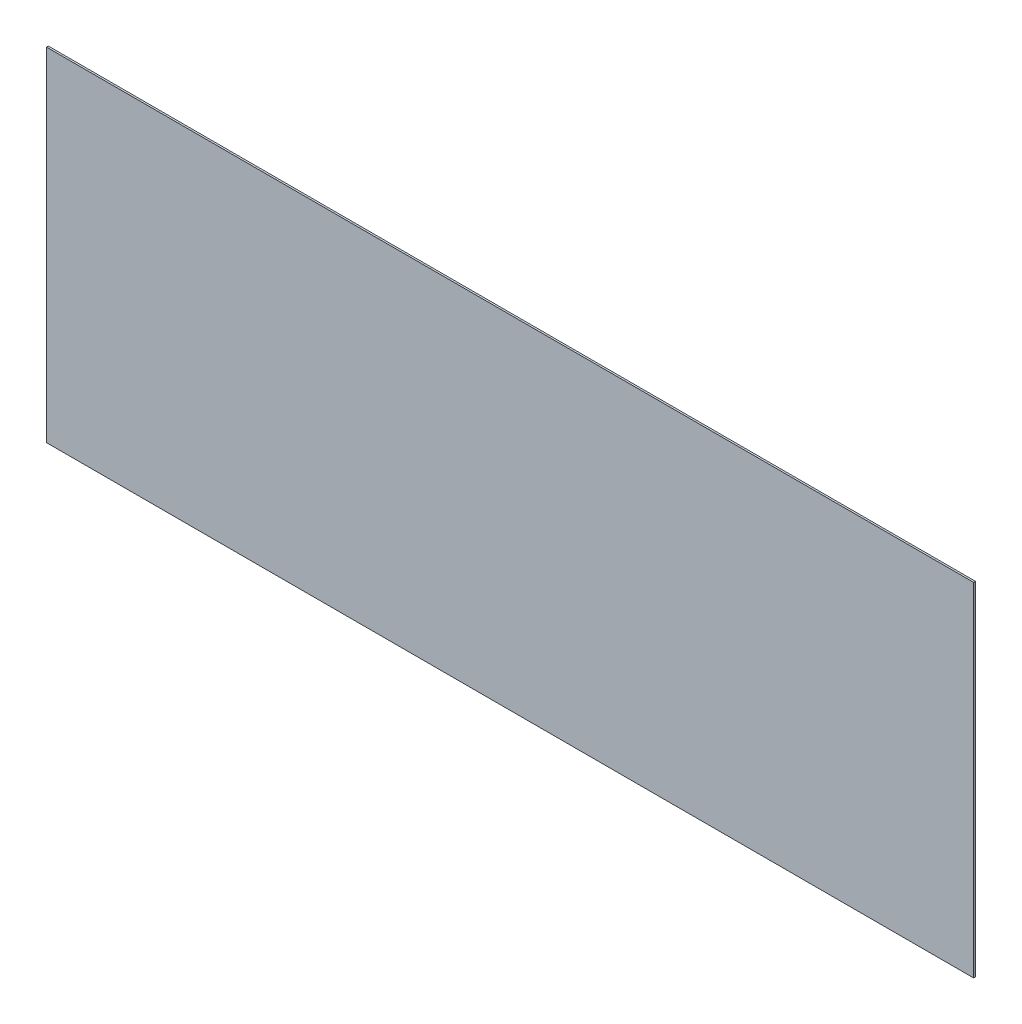
ISO-10303-21;
HEADER;
FILE_DESCRIPTION(('STEP AP214'),'2;1');
FILE_NAME('part.step','',(''),(''),'','','');
FILE_SCHEMA(('AUTOMOTIVE_DESIGN { 1 0 10303 214 1 1 1 1 }'));
ENDSEC;
DATA;
#1=APPLICATION_CONTEXT('core data for automotive mechanical design processes');
#2=APPLICATION_PROTOCOL_DEFINITION('international standard','automotive_design',2000,#1);
#3=PRODUCT_CONTEXT('',#1,'mechanical');
#4=PRODUCT('Part','Part','',(#3));
#5=PRODUCT_RELATED_PRODUCT_CATEGORY('part','',(#4));
#6=PRODUCT_DEFINITION_FORMATION('','',#4);
#7=PRODUCT_DEFINITION_CONTEXT('part definition',#1,'design');
#8=PRODUCT_DEFINITION('design','',#6,#7);
#9=PRODUCT_DEFINITION_SHAPE('','',#8);
#10=(LENGTH_UNIT() NAMED_UNIT(*) SI_UNIT(.MILLI.,.METRE.));
#11=(NAMED_UNIT(*) PLANE_ANGLE_UNIT() SI_UNIT($,.RADIAN.));
#12=(NAMED_UNIT(*) SI_UNIT($,.STERADIAN.) SOLID_ANGLE_UNIT());
#13=UNCERTAINTY_MEASURE_WITH_UNIT(LENGTH_MEASURE(1.E-05),#10,'distance_accuracy_value','');
#14=(GEOMETRIC_REPRESENTATION_CONTEXT(3) GLOBAL_UNCERTAINTY_ASSIGNED_CONTEXT((#13)) GLOBAL_UNIT_ASSIGNED_CONTEXT((#10,
#11,#12)) REPRESENTATION_CONTEXT('',''));
#15=CARTESIAN_POINT('',(0.,0.,0.));
#16=DIRECTION('',(0.,0.,1.));
#17=DIRECTION('',(1.,0.,0.));
#18=AXIS2_PLACEMENT_3D('',#15,#16,#17);
#19=CARTESIAN_POINT('',(-790.575,-292.1,3.175));
#20=DIRECTION('',(1.,0.,0.));
#21=DIRECTION('',(0.,0.,-1.));
#22=AXIS2_PLACEMENT_3D('',#19,#20,#21);
#23=PLANE('',#22);
#24=DIRECTION('',(0.,-1.,0.));
#25=VECTOR('',#24,1.);
#26=CARTESIAN_POINT('',(-790.575,-292.1,0.));
#27=LINE('',#26,#25);
#28=CARTESIAN_POINT('',(-790.575,292.1,0.));
#29=VERTEX_POINT('',#28);
#30=CARTESIAN_POINT('',(-790.575,-292.1,0.));
#31=VERTEX_POINT('',#30);
#32=EDGE_CURVE('E97',#29,#31,#27,.T.);
#33=ORIENTED_EDGE('',*,*,#32,.T.);
#34=DIRECTION('',(0.,0.,-1.));
#35=VECTOR('',#34,1.);
#36=CARTESIAN_POINT('',(-790.575,-292.1,3.175));
#37=LINE('',#36,#35);
#38=CARTESIAN_POINT('',(-790.575,-292.1,3.175));
#39=VERTEX_POINT('',#38);
#40=EDGE_CURVE('E11',#39,#31,#37,.T.);
#41=ORIENTED_EDGE('',*,*,#40,.F.);
#42=DIRECTION('',(0.,-1.,0.));
#43=VECTOR('',#42,1.);
#44=CARTESIAN_POINT('',(-790.575,-292.1,3.175));
#45=LINE('',#44,#43);
#46=CARTESIAN_POINT('',(-790.575,292.1,3.175));
#47=VERTEX_POINT('',#46);
#48=EDGE_CURVE('E85',#47,#39,#45,.T.);
#49=ORIENTED_EDGE('',*,*,#48,.F.);
#50=DIRECTION('',(0.,0.,-1.));
#51=VECTOR('',#50,1.);
#52=CARTESIAN_POINT('',(-790.575,292.1,3.175));
#53=LINE('',#52,#51);
#54=EDGE_CURVE('E93',#47,#29,#53,.T.);
#55=ORIENTED_EDGE('',*,*,#54,.T.);
#56=EDGE_LOOP('',(#33,#41,#49,#55));
#57=FACE_BOUND('',#56,.T.);
#58=ADVANCED_FACE('F34',(#57),#23,.F.);
#59=CARTESIAN_POINT('',(790.575,-292.1,3.175));
#60=DIRECTION('',(0.,1.,0.));
#61=DIRECTION('',(-1.,0.,0.));
#62=AXIS2_PLACEMENT_3D('',#59,#60,#61);
#63=PLANE('',#62);
#64=DIRECTION('',(1.,0.,0.));
#65=VECTOR('',#64,1.);
#66=CARTESIAN_POINT('',(790.575,-292.1,0.));
#67=LINE('',#66,#65);
#68=CARTESIAN_POINT('',(790.575,-292.1,0.));
#69=VERTEX_POINT('',#68);
#70=EDGE_CURVE('E89',#31,#69,#67,.T.);
#71=ORIENTED_EDGE('',*,*,#70,.T.);
#72=DIRECTION('',(0.,0.,-1.));
#73=VECTOR('',#72,1.);
#74=CARTESIAN_POINT('',(790.575,-292.1,3.175));
#75=LINE('',#74,#73);
#76=CARTESIAN_POINT('',(790.575,-292.1,3.175));
#77=VERTEX_POINT('',#76);
#78=EDGE_CURVE('E42',#77,#69,#75,.T.);
#79=ORIENTED_EDGE('',*,*,#78,.F.);
#80=DIRECTION('',(1.,0.,0.));
#81=VECTOR('',#80,1.);
#82=CARTESIAN_POINT('',(790.575,-292.1,3.175));
#83=LINE('',#82,#81);
#84=EDGE_CURVE('E80',#39,#77,#83,.T.);
#85=ORIENTED_EDGE('',*,*,#84,.F.);
#86=ORIENTED_EDGE('',*,*,#40,.T.);
#87=EDGE_LOOP('',(#71,#79,#85,#86));
#88=FACE_BOUND('',#87,.T.);
#89=ADVANCED_FACE('F88',(#88),#63,.F.);
#90=CARTESIAN_POINT('',(790.575,-292.1,3.175));
#91=DIRECTION('',(-1.,0.,0.));
#92=DIRECTION('',(0.,0.,1.));
#93=AXIS2_PLACEMENT_3D('',#90,#91,#92);
#94=PLANE('',#93);
#95=DIRECTION('',(0.,1.,0.));
#96=VECTOR('',#95,1.);
#97=CARTESIAN_POINT('',(790.575,-292.1,0.));
#98=LINE('',#97,#96);
#99=CARTESIAN_POINT('',(790.575,292.1,0.));
#100=VERTEX_POINT('',#99);
#101=EDGE_CURVE('E67',#69,#100,#98,.T.);
#102=ORIENTED_EDGE('',*,*,#101,.T.);
#103=DIRECTION('',(0.,0.,-1.));
#104=VECTOR('',#103,1.);
#105=CARTESIAN_POINT('',(790.575,292.1,3.175));
#106=LINE('',#105,#104);
#107=CARTESIAN_POINT('',(790.575,292.1,3.175));
#108=VERTEX_POINT('',#107);
#109=EDGE_CURVE('E90',#108,#100,#106,.T.);
#110=ORIENTED_EDGE('',*,*,#109,.F.);
#111=DIRECTION('',(0.,1.,0.));
#112=VECTOR('',#111,1.);
#113=CARTESIAN_POINT('',(790.575,-292.1,3.175));
#114=LINE('',#113,#112);
#115=EDGE_CURVE('E83',#77,#108,#114,.T.);
#116=ORIENTED_EDGE('',*,*,#115,.F.);
#117=ORIENTED_EDGE('',*,*,#78,.T.);
#118=EDGE_LOOP('',(#102,#110,#116,#117));
#119=FACE_BOUND('',#118,.T.);
#120=ADVANCED_FACE('F91',(#119),#94,.F.);
#121=CARTESIAN_POINT('',(790.575,292.1,3.175));
#122=DIRECTION('',(0.,-1.,0.));
#123=DIRECTION('',(1.,0.,0.));
#124=AXIS2_PLACEMENT_3D('',#121,#122,#123);
#125=PLANE('',#124);
#126=DIRECTION('',(-1.,0.,0.));
#127=VECTOR('',#126,1.);
#128=CARTESIAN_POINT('',(790.575,292.1,0.));
#129=LINE('',#128,#127);
#130=EDGE_CURVE('E73',#100,#29,#129,.T.);
#131=ORIENTED_EDGE('',*,*,#130,.T.);
#132=ORIENTED_EDGE('',*,*,#54,.F.);
#133=DIRECTION('',(-1.,0.,0.));
#134=VECTOR('',#133,1.);
#135=CARTESIAN_POINT('',(790.575,292.1,3.175));
#136=LINE('',#135,#134);
#137=EDGE_CURVE('E50',#108,#47,#136,.T.);
#138=ORIENTED_EDGE('',*,*,#137,.F.);
#139=ORIENTED_EDGE('',*,*,#109,.T.);
#140=EDGE_LOOP('',(#131,#132,#138,#139));
#141=FACE_BOUND('',#140,.T.);
#142=ADVANCED_FACE('F104',(#141),#125,.F.);
#143=CARTESIAN_POINT('',(0.,0.,3.175));
#144=DIRECTION('',(0.,0.,1.));
#145=DIRECTION('',(1.,0.,0.));
#146=AXIS2_PLACEMENT_3D('',#143,#144,#145);
#147=PLANE('',#146);
#148=ORIENTED_EDGE('',*,*,#48,.T.);
#149=ORIENTED_EDGE('',*,*,#84,.T.);
#150=ORIENTED_EDGE('',*,*,#115,.T.);
#151=ORIENTED_EDGE('',*,*,#137,.T.);
#152=EDGE_LOOP('',(#148,#149,#150,#151));
#153=FACE_BOUND('',#152,.T.);
#154=ADVANCED_FACE('F81',(#153),#147,.T.);
#155=CARTESIAN_POINT('',(0.,0.,0.));
#156=DIRECTION('',(0.,0.,1.));
#157=DIRECTION('',(1.,0.,0.));
#158=AXIS2_PLACEMENT_3D('',#155,#156,#157);
#159=PLANE('',#158);
#160=ORIENTED_EDGE('',*,*,#32,.F.);
#161=ORIENTED_EDGE('',*,*,#130,.F.);
#162=ORIENTED_EDGE('',*,*,#101,.F.);
#163=ORIENTED_EDGE('',*,*,#70,.F.);
#164=EDGE_LOOP('',(#160,#161,#162,#163));
#165=FACE_BOUND('',#164,.T.);
#166=ADVANCED_FACE('F107',(#165),#159,.F.);
#167=CLOSED_SHELL('',(#58,#89,#120,#142,#154,#166));
#168=MANIFOLD_SOLID_BREP('B2',#167);
#169=ADVANCED_BREP_SHAPE_REPRESENTATION('',(#18,#168),#14);
#170=SHAPE_DEFINITION_REPRESENTATION(#9,#169);
ENDSEC;
END-ISO-10303-21;
